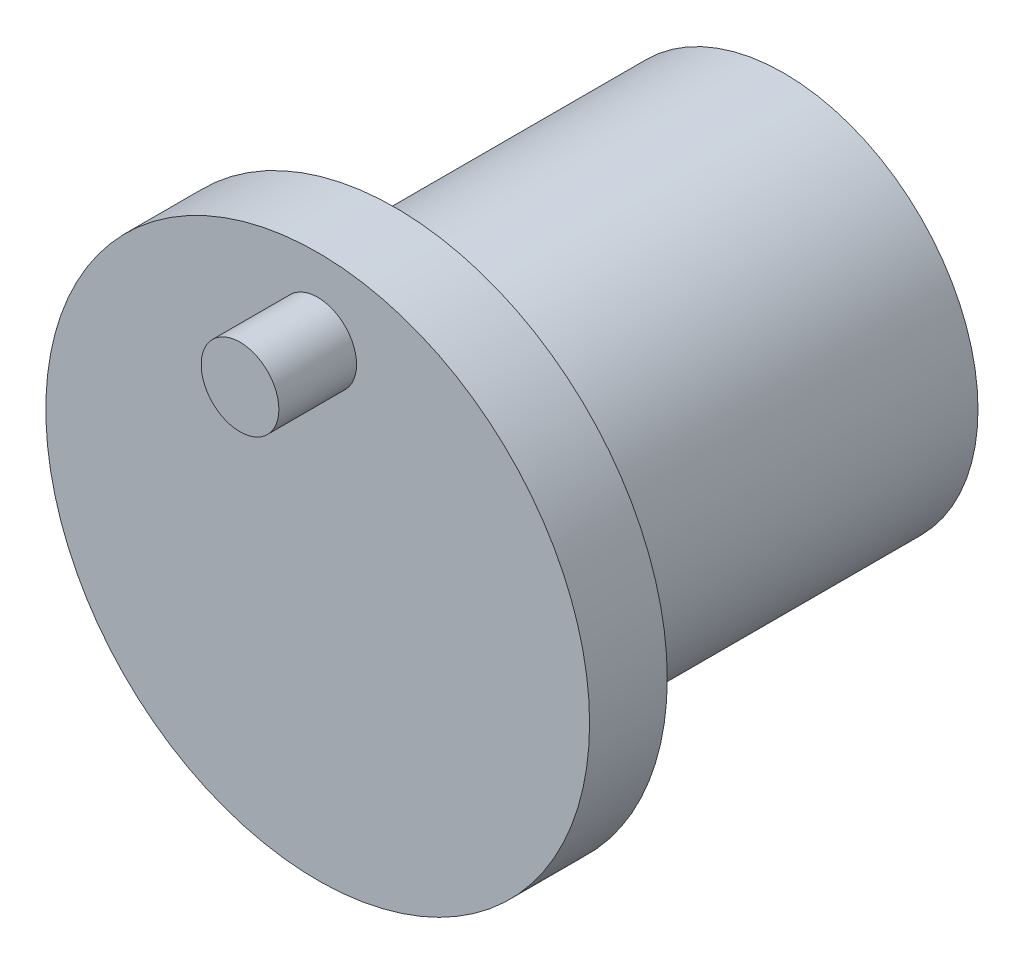
ISO-10303-21;
HEADER;
FILE_DESCRIPTION(('STEP AP214'),'2;1');
FILE_NAME('part.step','',(''),(''),'','','');
FILE_SCHEMA(('AUTOMOTIVE_DESIGN { 1 0 10303 214 1 1 1 1 }'));
ENDSEC;
DATA;
#1=APPLICATION_CONTEXT('core data for automotive mechanical design processes');
#2=APPLICATION_PROTOCOL_DEFINITION('international standard','automotive_design',2000,#1);
#3=PRODUCT_CONTEXT('',#1,'mechanical');
#4=PRODUCT('Part','Part','',(#3));
#5=PRODUCT_RELATED_PRODUCT_CATEGORY('part','',(#4));
#6=PRODUCT_DEFINITION_FORMATION('','',#4);
#7=PRODUCT_DEFINITION_CONTEXT('part definition',#1,'design');
#8=PRODUCT_DEFINITION('design','',#6,#7);
#9=PRODUCT_DEFINITION_SHAPE('','',#8);
#10=(LENGTH_UNIT() NAMED_UNIT(*) SI_UNIT(.MILLI.,.METRE.));
#11=(NAMED_UNIT(*) PLANE_ANGLE_UNIT() SI_UNIT($,.RADIAN.));
#12=(NAMED_UNIT(*) SI_UNIT($,.STERADIAN.) SOLID_ANGLE_UNIT());
#13=UNCERTAINTY_MEASURE_WITH_UNIT(LENGTH_MEASURE(1.E-05),#10,'distance_accuracy_value','');
#14=(GEOMETRIC_REPRESENTATION_CONTEXT(3) GLOBAL_UNCERTAINTY_ASSIGNED_CONTEXT((#13)) GLOBAL_UNIT_ASSIGNED_CONTEXT((#10,
#11,#12)) REPRESENTATION_CONTEXT('',''));
#15=CARTESIAN_POINT('',(0.,0.,0.));
#16=DIRECTION('',(0.,0.,1.));
#17=DIRECTION('',(1.,0.,0.));
#18=AXIS2_PLACEMENT_3D('',#15,#16,#17);
#19=CARTESIAN_POINT('',(0.,0.,-2.));
#20=DIRECTION('',(0.,0.,1.));
#21=DIRECTION('',(1.,0.,0.));
#22=AXIS2_PLACEMENT_3D('',#19,#20,#21);
#23=CYLINDRICAL_SURFACE('',#22,7.);
#24=CARTESIAN_POINT('',(0.,0.,-2.));
#25=DIRECTION('',(0.,0.,1.));
#26=DIRECTION('',(1.,0.,0.));
#27=AXIS2_PLACEMENT_3D('',#24,#25,#26);
#28=CIRCLE('',#27,7.);
#29=CARTESIAN_POINT('',(7.,0.,-2.));
#30=VERTEX_POINT('',#29);
#31=EDGE_CURVE('E51',#30,#30,#28,.T.);
#32=ORIENTED_EDGE('',*,*,#31,.T.);
#33=EDGE_LOOP('',(#32));
#34=FACE_BOUND('',#33,.T.);
#35=CARTESIAN_POINT('',(0.,0.,0.));
#36=DIRECTION('',(0.,0.,1.));
#37=DIRECTION('',(1.,0.,0.));
#38=AXIS2_PLACEMENT_3D('',#35,#36,#37);
#39=CIRCLE('',#38,7.);
#40=CARTESIAN_POINT('',(7.,0.,0.));
#41=VERTEX_POINT('',#40);
#42=EDGE_CURVE('E46',#41,#41,#39,.T.);
#43=ORIENTED_EDGE('',*,*,#42,.F.);
#44=EDGE_LOOP('',(#43));
#45=FACE_BOUND('',#44,.T.);
#46=ADVANCED_FACE('F43',(#34,#45),#23,.T.);
#47=CARTESIAN_POINT('',(0.,0.,-2.));
#48=DIRECTION('',(0.,0.,1.));
#49=DIRECTION('',(1.,0.,0.));
#50=AXIS2_PLACEMENT_3D('',#47,#48,#49);
#51=PLANE('',#50);
#52=CARTESIAN_POINT('',(0.,0.,-2.));
#53=DIRECTION('',(0.,0.,-1.));
#54=DIRECTION('',(-1.,0.,0.));
#55=AXIS2_PLACEMENT_3D('',#52,#53,#54);
#56=CIRCLE('',#55,5.);
#57=CARTESIAN_POINT('',(-5.,0.,-2.));
#58=VERTEX_POINT('',#57);
#59=EDGE_CURVE('E10',#58,#58,#56,.T.);
#60=ORIENTED_EDGE('',*,*,#59,.F.);
#61=EDGE_LOOP('',(#60));
#62=FACE_BOUND('',#61,.T.);
#63=ORIENTED_EDGE('',*,*,#31,.F.);
#64=EDGE_LOOP('',(#63));
#65=FACE_BOUND('',#64,.T.);
#66=ADVANCED_FACE('F89',(#62,#65),#51,.F.);
#67=CARTESIAN_POINT('',(0.,0.,0.));
#68=DIRECTION('',(0.,0.,1.));
#69=DIRECTION('',(1.,0.,0.));
#70=AXIS2_PLACEMENT_3D('',#67,#68,#69);
#71=PLANE('',#70);
#72=CARTESIAN_POINT('',(0.,5.,0.));
#73=DIRECTION('',(0.,0.,1.));
#74=DIRECTION('',(1.,0.,0.));
#75=AXIS2_PLACEMENT_3D('',#72,#73,#74);
#76=CIRCLE('',#75,1.);
#77=CARTESIAN_POINT('',(1.,5.,0.));
#78=VERTEX_POINT('',#77);
#79=EDGE_CURVE('E64',#78,#78,#76,.T.);
#80=ORIENTED_EDGE('',*,*,#79,.F.);
#81=EDGE_LOOP('',(#80));
#82=FACE_BOUND('',#81,.T.);
#83=ORIENTED_EDGE('',*,*,#42,.T.);
#84=EDGE_LOOP('',(#83));
#85=FACE_BOUND('',#84,.T.);
#86=ADVANCED_FACE('F94',(#82,#85),#71,.T.);
#87=CARTESIAN_POINT('',(0.,5.,2.));
#88=DIRECTION('',(0.,0.,-1.));
#89=DIRECTION('',(-1.,0.,0.));
#90=AXIS2_PLACEMENT_3D('',#87,#88,#89);
#91=CYLINDRICAL_SURFACE('',#90,1.);
#92=CARTESIAN_POINT('',(0.,5.,2.));
#93=DIRECTION('',(0.,0.,1.));
#94=DIRECTION('',(1.,0.,0.));
#95=AXIS2_PLACEMENT_3D('',#92,#93,#94);
#96=CIRCLE('',#95,1.);
#97=CARTESIAN_POINT('',(1.,5.,2.));
#98=VERTEX_POINT('',#97);
#99=EDGE_CURVE('E60',#98,#98,#96,.T.);
#100=ORIENTED_EDGE('',*,*,#99,.F.);
#101=EDGE_LOOP('',(#100));
#102=FACE_BOUND('',#101,.T.);
#103=ORIENTED_EDGE('',*,*,#79,.T.);
#104=EDGE_LOOP('',(#103));
#105=FACE_BOUND('',#104,.T.);
#106=ADVANCED_FACE('F85',(#102,#105),#91,.T.);
#107=CARTESIAN_POINT('',(0.,5.,2.));
#108=DIRECTION('',(0.,0.,1.));
#109=DIRECTION('',(1.,0.,0.));
#110=AXIS2_PLACEMENT_3D('',#107,#108,#109);
#111=PLANE('',#110);
#112=ORIENTED_EDGE('',*,*,#99,.T.);
#113=EDGE_LOOP('',(#112));
#114=FACE_BOUND('',#113,.T.);
#115=ADVANCED_FACE('F77',(#114),#111,.T.);
#116=CARTESIAN_POINT('',(0.,0.,-12.));
#117=DIRECTION('',(0.,0.,1.));
#118=DIRECTION('',(1.,0.,0.));
#119=AXIS2_PLACEMENT_3D('',#116,#117,#118);
#120=CYLINDRICAL_SURFACE('',#119,5.);
#121=CARTESIAN_POINT('',(0.,0.,-12.));
#122=DIRECTION('',(0.,0.,-1.));
#123=DIRECTION('',(-1.,0.,0.));
#124=AXIS2_PLACEMENT_3D('',#121,#122,#123);
#125=CIRCLE('',#124,5.);
#126=CARTESIAN_POINT('',(-5.,0.,-12.));
#127=VERTEX_POINT('',#126);
#128=EDGE_CURVE('E59',#127,#127,#125,.T.);
#129=ORIENTED_EDGE('',*,*,#128,.F.);
#130=EDGE_LOOP('',(#129));
#131=FACE_BOUND('',#130,.T.);
#132=ORIENTED_EDGE('',*,*,#59,.T.);
#133=EDGE_LOOP('',(#132));
#134=FACE_BOUND('',#133,.T.);
#135=ADVANCED_FACE('F75',(#131,#134),#120,.T.);
#136=CARTESIAN_POINT('',(0.,0.,-12.));
#137=DIRECTION('',(0.,0.,-1.));
#138=DIRECTION('',(-1.,0.,0.));
#139=AXIS2_PLACEMENT_3D('',#136,#137,#138);
#140=PLANE('',#139);
#141=ORIENTED_EDGE('',*,*,#128,.T.);
#142=EDGE_LOOP('',(#141));
#143=FACE_BOUND('',#142,.T.);
#144=ADVANCED_FACE('F73',(#143),#140,.T.);
#145=CLOSED_SHELL('',(#46,#66,#86,#106,#115,#135,#144));
#146=MANIFOLD_SOLID_BREP('B2',#145);
#147=ADVANCED_BREP_SHAPE_REPRESENTATION('',(#18,#146),#14);
#148=SHAPE_DEFINITION_REPRESENTATION(#9,#147);
ENDSEC;
END-ISO-10303-21;
